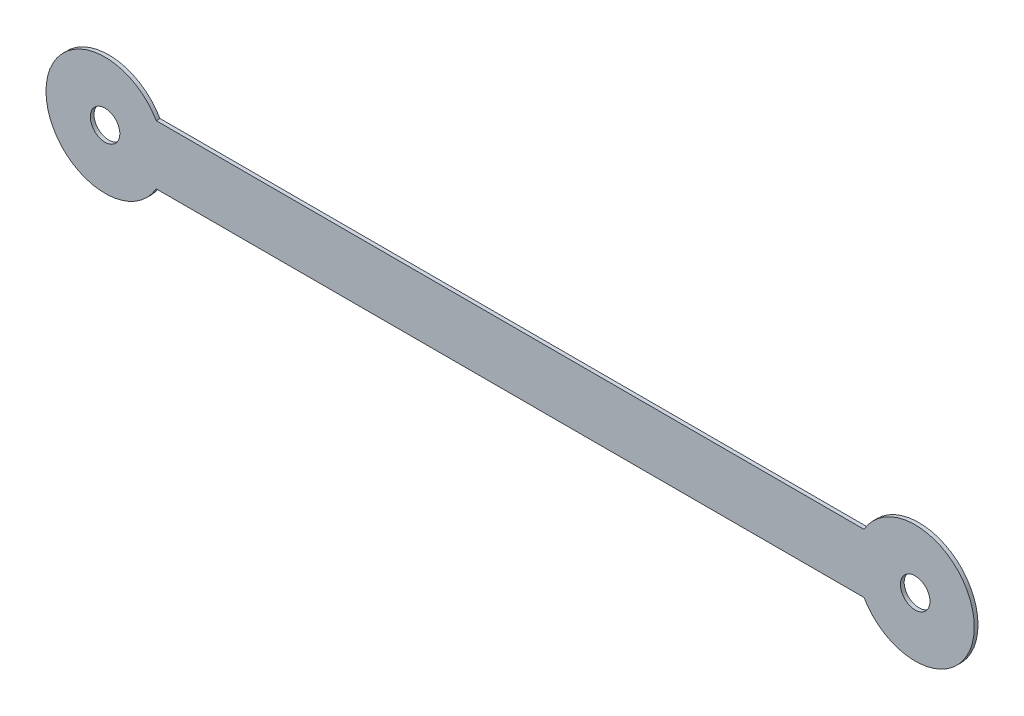
ISO-10303-21;
HEADER;
FILE_DESCRIPTION(('STEP AP214'),'2;1');
FILE_NAME('part.step','',(''),(''),'','','');
FILE_SCHEMA(('AUTOMOTIVE_DESIGN { 1 0 10303 214 1 1 1 1 }'));
ENDSEC;
DATA;
#1=APPLICATION_CONTEXT('core data for automotive mechanical design processes');
#2=APPLICATION_PROTOCOL_DEFINITION('international standard','automotive_design',2000,#1);
#3=PRODUCT_CONTEXT('',#1,'mechanical');
#4=PRODUCT('Part','Part','',(#3));
#5=PRODUCT_RELATED_PRODUCT_CATEGORY('part','',(#4));
#6=PRODUCT_DEFINITION_FORMATION('','',#4);
#7=PRODUCT_DEFINITION_CONTEXT('part definition',#1,'design');
#8=PRODUCT_DEFINITION('design','',#6,#7);
#9=PRODUCT_DEFINITION_SHAPE('','',#8);
#10=(LENGTH_UNIT() NAMED_UNIT(*) SI_UNIT(.MILLI.,.METRE.));
#11=(NAMED_UNIT(*) PLANE_ANGLE_UNIT() SI_UNIT($,.RADIAN.));
#12=(NAMED_UNIT(*) SI_UNIT($,.STERADIAN.) SOLID_ANGLE_UNIT());
#13=UNCERTAINTY_MEASURE_WITH_UNIT(LENGTH_MEASURE(1.E-05),#10,'distance_accuracy_value','');
#14=(GEOMETRIC_REPRESENTATION_CONTEXT(3) GLOBAL_UNCERTAINTY_ASSIGNED_CONTEXT((#13)) GLOBAL_UNIT_ASSIGNED_CONTEXT((#10,
#11,#12)) REPRESENTATION_CONTEXT('',''));
#15=CARTESIAN_POINT('',(0.,0.,0.));
#16=DIRECTION('',(0.,0.,1.));
#17=DIRECTION('',(1.,0.,0.));
#18=AXIS2_PLACEMENT_3D('',#15,#16,#17);
#19=CARTESIAN_POINT('',(0.,0.,0.254));
#20=DIRECTION('',(0.,0.,1.));
#21=DIRECTION('',(1.,0.,0.));
#22=AXIS2_PLACEMENT_3D('',#19,#20,#21);
#23=PLANE('',#22);
#24=DIRECTION('',(1.,0.,0.));
#25=VECTOR('',#24,1.);
#26=CARTESIAN_POINT('',(51.3998983848623,-2.,0.254));
#27=LINE('',#26,#25);
#28=CARTESIAN_POINT('',(3.46410161513775,-2.,0.254));
#29=VERTEX_POINT('',#28);
#30=CARTESIAN_POINT('',(51.3998983848623,-2.,0.254));
#31=VERTEX_POINT('',#30);
#32=EDGE_CURVE('E91',#29,#31,#27,.T.);
#33=ORIENTED_EDGE('',*,*,#32,.T.);
#34=CARTESIAN_POINT('',(54.864,0.,0.254));
#35=DIRECTION('',(0.,0.,1.));
#36=DIRECTION('',(1.,0.,0.));
#37=AXIS2_PLACEMENT_3D('',#34,#35,#36);
#38=CIRCLE('',#37,4.);
#39=CARTESIAN_POINT('',(51.3998983848623,2.,0.254));
#40=VERTEX_POINT('',#39);
#41=EDGE_CURVE('E11',#31,#40,#38,.T.);
#42=ORIENTED_EDGE('',*,*,#41,.T.);
#43=DIRECTION('',(-1.,0.,0.));
#44=VECTOR('',#43,1.);
#45=CARTESIAN_POINT('',(51.3998983848623,2.,0.254));
#46=LINE('',#45,#44);
#47=CARTESIAN_POINT('',(3.46410161513775,2.,0.254));
#48=VERTEX_POINT('',#47);
#49=EDGE_CURVE('E96',#40,#48,#46,.T.);
#50=ORIENTED_EDGE('',*,*,#49,.T.);
#51=CARTESIAN_POINT('',(0.,0.,0.254));
#52=DIRECTION('',(0.,0.,1.));
#53=DIRECTION('',(1.,0.,0.));
#54=AXIS2_PLACEMENT_3D('',#51,#52,#53);
#55=CIRCLE('',#54,4.);
#56=EDGE_CURVE('E42',#48,#29,#55,.T.);
#57=ORIENTED_EDGE('',*,*,#56,.T.);
#58=EDGE_LOOP('',(#33,#42,#50,#57));
#59=FACE_BOUND('',#58,.T.);
#60=CARTESIAN_POINT('',(0.,0.,0.254));
#61=DIRECTION('',(0.,0.,1.));
#62=DIRECTION('',(1.,0.,0.));
#63=AXIS2_PLACEMENT_3D('',#60,#61,#62);
#64=CIRCLE('',#63,1.);
#65=CARTESIAN_POINT('',(1.,0.,0.254));
#66=VERTEX_POINT('',#65);
#67=EDGE_CURVE('E111',#66,#66,#64,.T.);
#68=ORIENTED_EDGE('',*,*,#67,.F.);
#69=EDGE_LOOP('',(#68));
#70=FACE_BOUND('',#69,.T.);
#71=CARTESIAN_POINT('',(54.864,0.,0.254));
#72=DIRECTION('',(0.,0.,1.));
#73=DIRECTION('',(1.,0.,0.));
#74=AXIS2_PLACEMENT_3D('',#71,#72,#73);
#75=CIRCLE('',#74,0.999999999999998);
#76=CARTESIAN_POINT('',(55.864,0.,0.254));
#77=VERTEX_POINT('',#76);
#78=EDGE_CURVE('E105',#77,#77,#75,.T.);
#79=ORIENTED_EDGE('',*,*,#78,.F.);
#80=EDGE_LOOP('',(#79));
#81=FACE_BOUND('',#80,.T.);
#82=ADVANCED_FACE('F32',(#59,#70,#81),#23,.T.);
#83=CARTESIAN_POINT('',(0.,0.,0.));
#84=DIRECTION('',(0.,0.,1.));
#85=DIRECTION('',(1.,0.,0.));
#86=AXIS2_PLACEMENT_3D('',#83,#84,#85);
#87=PLANE('',#86);
#88=CARTESIAN_POINT('',(54.864,0.,0.));
#89=DIRECTION('',(0.,0.,1.));
#90=DIRECTION('',(1.,0.,0.));
#91=AXIS2_PLACEMENT_3D('',#88,#89,#90);
#92=CIRCLE('',#91,4.);
#93=CARTESIAN_POINT('',(51.3998983848623,-2.,0.));
#94=VERTEX_POINT('',#93);
#95=CARTESIAN_POINT('',(51.3998983848623,2.,0.));
#96=VERTEX_POINT('',#95);
#97=EDGE_CURVE('E36',#94,#96,#92,.T.);
#98=ORIENTED_EDGE('',*,*,#97,.F.);
#99=DIRECTION('',(1.,0.,0.));
#100=VECTOR('',#99,1.);
#101=CARTESIAN_POINT('',(51.3998983848623,-2.,0.));
#102=LINE('',#101,#100);
#103=CARTESIAN_POINT('',(3.46410161513775,-2.,0.));
#104=VERTEX_POINT('',#103);
#105=EDGE_CURVE('E78',#104,#94,#102,.T.);
#106=ORIENTED_EDGE('',*,*,#105,.F.);
#107=CARTESIAN_POINT('',(0.,0.,0.));
#108=DIRECTION('',(0.,0.,1.));
#109=DIRECTION('',(1.,0.,0.));
#110=AXIS2_PLACEMENT_3D('',#107,#108,#109);
#111=CIRCLE('',#110,4.);
#112=CARTESIAN_POINT('',(3.46410161513775,2.,0.));
#113=VERTEX_POINT('',#112);
#114=EDGE_CURVE('E81',#113,#104,#111,.T.);
#115=ORIENTED_EDGE('',*,*,#114,.F.);
#116=DIRECTION('',(-1.,0.,0.));
#117=VECTOR('',#116,1.);
#118=CARTESIAN_POINT('',(51.3998983848623,2.,0.));
#119=LINE('',#118,#117);
#120=EDGE_CURVE('E80',#96,#113,#119,.T.);
#121=ORIENTED_EDGE('',*,*,#120,.F.);
#122=EDGE_LOOP('',(#98,#106,#115,#121));
#123=FACE_BOUND('',#122,.T.);
#124=CARTESIAN_POINT('',(0.,0.,0.));
#125=DIRECTION('',(0.,0.,1.));
#126=DIRECTION('',(1.,0.,0.));
#127=AXIS2_PLACEMENT_3D('',#124,#125,#126);
#128=CIRCLE('',#127,1.);
#129=CARTESIAN_POINT('',(1.,0.,0.));
#130=VERTEX_POINT('',#129);
#131=EDGE_CURVE('E108',#130,#130,#128,.T.);
#132=ORIENTED_EDGE('',*,*,#131,.T.);
#133=EDGE_LOOP('',(#132));
#134=FACE_BOUND('',#133,.T.);
#135=CARTESIAN_POINT('',(54.864,0.,0.));
#136=DIRECTION('',(0.,0.,1.));
#137=DIRECTION('',(1.,0.,0.));
#138=AXIS2_PLACEMENT_3D('',#135,#136,#137);
#139=CIRCLE('',#138,0.999999999999998);
#140=CARTESIAN_POINT('',(55.864,0.,0.));
#141=VERTEX_POINT('',#140);
#142=EDGE_CURVE('E103',#141,#141,#139,.T.);
#143=ORIENTED_EDGE('',*,*,#142,.T.);
#144=EDGE_LOOP('',(#143));
#145=FACE_BOUND('',#144,.T.);
#146=ADVANCED_FACE('F75',(#123,#134,#145),#87,.F.);
#147=CARTESIAN_POINT('',(0.,0.,0.254));
#148=DIRECTION('',(0.,0.,-1.));
#149=DIRECTION('',(-1.,0.,0.));
#150=AXIS2_PLACEMENT_3D('',#147,#148,#149);
#151=CYLINDRICAL_SURFACE('',#150,4.);
#152=ORIENTED_EDGE('',*,*,#114,.T.);
#153=DIRECTION('',(0.,0.,-1.));
#154=VECTOR('',#153,1.);
#155=CARTESIAN_POINT('',(3.46410161513775,-2.,0.254));
#156=LINE('',#155,#154);
#157=EDGE_CURVE('E87',#29,#104,#156,.T.);
#158=ORIENTED_EDGE('',*,*,#157,.F.);
#159=ORIENTED_EDGE('',*,*,#56,.F.);
#160=DIRECTION('',(0.,0.,-1.));
#161=VECTOR('',#160,1.);
#162=CARTESIAN_POINT('',(3.46410161513775,2.,0.254));
#163=LINE('',#162,#161);
#164=EDGE_CURVE('E101',#48,#113,#163,.T.);
#165=ORIENTED_EDGE('',*,*,#164,.T.);
#166=EDGE_LOOP('',(#152,#158,#159,#165));
#167=FACE_BOUND('',#166,.T.);
#168=ADVANCED_FACE('F34',(#167),#151,.T.);
#169=CARTESIAN_POINT('',(54.864,0.,0.254));
#170=DIRECTION('',(0.,0.,-1.));
#171=DIRECTION('',(-1.,0.,0.));
#172=AXIS2_PLACEMENT_3D('',#169,#170,#171);
#173=CYLINDRICAL_SURFACE('',#172,4.);
#174=ORIENTED_EDGE('',*,*,#97,.T.);
#175=DIRECTION('',(0.,0.,-1.));
#176=VECTOR('',#175,1.);
#177=CARTESIAN_POINT('',(51.3998983848623,2.,0.254));
#178=LINE('',#177,#176);
#179=EDGE_CURVE('E99',#40,#96,#178,.T.);
#180=ORIENTED_EDGE('',*,*,#179,.F.);
#181=ORIENTED_EDGE('',*,*,#41,.F.);
#182=DIRECTION('',(0.,0.,-1.));
#183=VECTOR('',#182,1.);
#184=CARTESIAN_POINT('',(51.3998983848623,-2.,0.254));
#185=LINE('',#184,#183);
#186=EDGE_CURVE('E82',#31,#94,#185,.T.);
#187=ORIENTED_EDGE('',*,*,#186,.T.);
#188=EDGE_LOOP('',(#174,#180,#181,#187));
#189=FACE_BOUND('',#188,.T.);
#190=ADVANCED_FACE('F83',(#189),#173,.T.);
#191=CARTESIAN_POINT('',(0.,0.,0.254));
#192=DIRECTION('',(0.,0.,-1.));
#193=DIRECTION('',(-1.,0.,0.));
#194=AXIS2_PLACEMENT_3D('',#191,#192,#193);
#195=CYLINDRICAL_SURFACE('',#194,1.);
#196=ORIENTED_EDGE('',*,*,#67,.T.);
#197=EDGE_LOOP('',(#196));
#198=FACE_BOUND('',#197,.T.);
#199=ORIENTED_EDGE('',*,*,#131,.F.);
#200=EDGE_LOOP('',(#199));
#201=FACE_BOUND('',#200,.T.);
#202=ADVANCED_FACE('F130',(#198,#201),#195,.F.);
#203=CARTESIAN_POINT('',(54.864,0.,0.254));
#204=DIRECTION('',(0.,0.,-1.));
#205=DIRECTION('',(-1.,0.,0.));
#206=AXIS2_PLACEMENT_3D('',#203,#204,#205);
#207=CYLINDRICAL_SURFACE('',#206,0.999999999999998);
#208=ORIENTED_EDGE('',*,*,#78,.T.);
#209=EDGE_LOOP('',(#208));
#210=FACE_BOUND('',#209,.T.);
#211=ORIENTED_EDGE('',*,*,#142,.F.);
#212=EDGE_LOOP('',(#211));
#213=FACE_BOUND('',#212,.T.);
#214=ADVANCED_FACE('F127',(#210,#213),#207,.F.);
#215=CARTESIAN_POINT('',(51.3998983848623,2.,0.254));
#216=DIRECTION('',(0.,-1.,0.));
#217=DIRECTION('',(0.,0.,-1.));
#218=AXIS2_PLACEMENT_3D('',#215,#216,#217);
#219=PLANE('',#218);
#220=ORIENTED_EDGE('',*,*,#120,.T.);
#221=ORIENTED_EDGE('',*,*,#164,.F.);
#222=ORIENTED_EDGE('',*,*,#49,.F.);
#223=ORIENTED_EDGE('',*,*,#179,.T.);
#224=EDGE_LOOP('',(#220,#221,#222,#223));
#225=FACE_BOUND('',#224,.T.);
#226=ADVANCED_FACE('F118',(#225),#219,.F.);
#227=CARTESIAN_POINT('',(51.3998983848623,-2.,0.254));
#228=DIRECTION('',(0.,1.,0.));
#229=DIRECTION('',(0.,0.,1.));
#230=AXIS2_PLACEMENT_3D('',#227,#228,#229);
#231=PLANE('',#230);
#232=ORIENTED_EDGE('',*,*,#105,.T.);
#233=ORIENTED_EDGE('',*,*,#186,.F.);
#234=ORIENTED_EDGE('',*,*,#32,.F.);
#235=ORIENTED_EDGE('',*,*,#157,.T.);
#236=EDGE_LOOP('',(#232,#233,#234,#235));
#237=FACE_BOUND('',#236,.T.);
#238=ADVANCED_FACE('F90',(#237),#231,.F.);
#239=CLOSED_SHELL('',(#82,#146,#168,#190,#202,#214,#226,#238));
#240=MANIFOLD_SOLID_BREP('B2',#239);
#241=ADVANCED_BREP_SHAPE_REPRESENTATION('',(#18,#240),#14);
#242=SHAPE_DEFINITION_REPRESENTATION(#9,#241);
ENDSEC;
END-ISO-10303-21;
